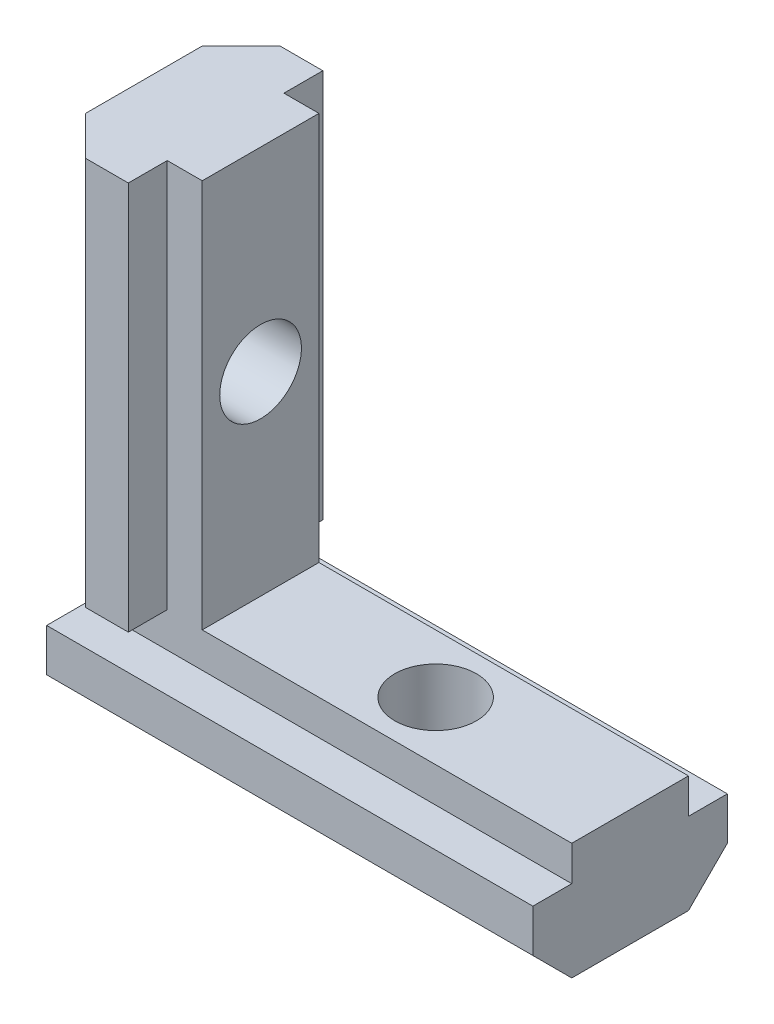
ISO-10303-21;
HEADER;
FILE_DESCRIPTION(('STEP AP214'),'2;1');
FILE_NAME('part.step','',(''),(''),'','','');
FILE_SCHEMA(('AUTOMOTIVE_DESIGN { 1 0 10303 214 1 1 1 1 }'));
ENDSEC;
DATA;
#1=APPLICATION_CONTEXT('core data for automotive mechanical design processes');
#2=APPLICATION_PROTOCOL_DEFINITION('international standard','automotive_design',2000,#1);
#3=PRODUCT_CONTEXT('',#1,'mechanical');
#4=PRODUCT('Part','Part','',(#3));
#5=PRODUCT_RELATED_PRODUCT_CATEGORY('part','',(#4));
#6=PRODUCT_DEFINITION_FORMATION('','',#4);
#7=PRODUCT_DEFINITION_CONTEXT('part definition',#1,'design');
#8=PRODUCT_DEFINITION('design','',#6,#7);
#9=PRODUCT_DEFINITION_SHAPE('','',#8);
#10=(LENGTH_UNIT() NAMED_UNIT(*) SI_UNIT(.MILLI.,.METRE.));
#11=(NAMED_UNIT(*) PLANE_ANGLE_UNIT() SI_UNIT($,.RADIAN.));
#12=(NAMED_UNIT(*) SI_UNIT($,.STERADIAN.) SOLID_ANGLE_UNIT());
#13=UNCERTAINTY_MEASURE_WITH_UNIT(LENGTH_MEASURE(1.E-05),#10,'distance_accuracy_value','');
#14=(GEOMETRIC_REPRESENTATION_CONTEXT(3) GLOBAL_UNCERTAINTY_ASSIGNED_CONTEXT((#13)) GLOBAL_UNIT_ASSIGNED_CONTEXT((#10,
#11,#12)) REPRESENTATION_CONTEXT('',''));
#15=CARTESIAN_POINT('',(0.,0.,0.));
#16=DIRECTION('',(0.,0.,1.));
#17=DIRECTION('',(1.,0.,0.));
#18=AXIS2_PLACEMENT_3D('',#15,#16,#17);
#19=CARTESIAN_POINT('',(0.,0.,0.));
#20=DIRECTION('',(0.,1.,0.));
#21=DIRECTION('',(0.,0.,1.));
#22=AXIS2_PLACEMENT_3D('',#19,#20,#21);
#23=PLANE('',#22);
#24=DIRECTION('',(-1.,0.,0.));
#25=VECTOR('',#24,1.);
#26=CARTESIAN_POINT('',(22.,0.,3.00000000000001));
#27=LINE('',#26,#25);
#28=CARTESIAN_POINT('',(1.2,0.,3.));
#29=VERTEX_POINT('',#28);
#30=CARTESIAN_POINT('',(-3.,0.,3.));
#31=VERTEX_POINT('',#30);
#32=EDGE_CURVE('E11',#29,#31,#27,.T.);
#33=ORIENTED_EDGE('',*,*,#32,.F.);
#34=DIRECTION('',(0.,0.,-1.));
#35=VECTOR('',#34,1.);
#36=CARTESIAN_POINT('',(1.2,0.,5.));
#37=LINE('',#36,#35);
#38=CARTESIAN_POINT('',(1.2,0.,5.));
#39=VERTEX_POINT('',#38);
#40=EDGE_CURVE('E134',#39,#29,#37,.T.);
#41=ORIENTED_EDGE('',*,*,#40,.F.);
#42=DIRECTION('',(1.,0.,0.));
#43=VECTOR('',#42,1.);
#44=CARTESIAN_POINT('',(-1.00000000000002,0.,5.));
#45=LINE('',#44,#43);
#46=CARTESIAN_POINT('',(-1.00000000000002,0.,5.));
#47=VERTEX_POINT('',#46);
#48=EDGE_CURVE('E88',#47,#39,#45,.T.);
#49=ORIENTED_EDGE('',*,*,#48,.F.);
#50=DIRECTION('',(0.707106781186544,0.,0.707106781186551));
#51=VECTOR('',#50,1.);
#52=CARTESIAN_POINT('',(-3.,0.,3.));
#53=LINE('',#52,#51);
#54=EDGE_CURVE('E81',#31,#47,#53,.T.);
#55=ORIENTED_EDGE('',*,*,#54,.F.);
#56=EDGE_LOOP('',(#33,#41,#49,#55));
#57=FACE_BOUND('',#56,.T.);
#58=ADVANCED_FACE('F40',(#57),#23,.F.);
#59=CARTESIAN_POINT('',(1.2,20.,-3.));
#60=DIRECTION('',(0.,0.,1.));
#61=DIRECTION('',(1.,0.,0.));
#62=AXIS2_PLACEMENT_3D('',#59,#60,#61);
#63=PLANE('',#62);
#64=DIRECTION('',(0.,-1.,0.));
#65=VECTOR('',#64,1.);
#66=CARTESIAN_POINT('',(3.,20.,-3.));
#67=LINE('',#66,#65);
#68=CARTESIAN_POINT('',(3.,20.,-3.));
#69=VERTEX_POINT('',#68);
#70=CARTESIAN_POINT('',(3.,0.,-3.));
#71=VERTEX_POINT('',#70);
#72=EDGE_CURVE('E143',#69,#71,#67,.T.);
#73=ORIENTED_EDGE('',*,*,#72,.T.);
#74=DIRECTION('',(-1.,0.,0.));
#75=VECTOR('',#74,1.);
#76=CARTESIAN_POINT('',(22.,0.,-2.99999999999999));
#77=LINE('',#76,#75);
#78=CARTESIAN_POINT('',(22.,0.,-2.99999999999999));
#79=VERTEX_POINT('',#78);
#80=EDGE_CURVE('E150',#79,#71,#77,.T.);
#81=ORIENTED_EDGE('',*,*,#80,.F.);
#82=DIRECTION('',(0.,-1.,0.));
#83=VECTOR('',#82,1.);
#84=CARTESIAN_POINT('',(22.,-1.8,-2.99999999999999));
#85=LINE('',#84,#83);
#86=CARTESIAN_POINT('',(22.,-1.8,-2.99999999999999));
#87=VERTEX_POINT('',#86);
#88=EDGE_CURVE('E254',#79,#87,#85,.T.);
#89=ORIENTED_EDGE('',*,*,#88,.T.);
#90=DIRECTION('',(-1.,0.,0.));
#91=VECTOR('',#90,1.);
#92=CARTESIAN_POINT('',(22.,-1.8,-2.99999999999999));
#93=LINE('',#92,#91);
#94=CARTESIAN_POINT('',(-3.,-1.8,-3.));
#95=VERTEX_POINT('',#94);
#96=EDGE_CURVE('E219',#87,#95,#93,.T.);
#97=ORIENTED_EDGE('',*,*,#96,.T.);
#98=DIRECTION('',(0.,-1.,0.));
#99=VECTOR('',#98,1.);
#100=CARTESIAN_POINT('',(-3.,-1.8,-3.));
#101=LINE('',#100,#99);
#102=CARTESIAN_POINT('',(-3.,0.,-3.));
#103=VERTEX_POINT('',#102);
#104=EDGE_CURVE('E277',#103,#95,#101,.T.);
#105=ORIENTED_EDGE('',*,*,#104,.F.);
#106=CARTESIAN_POINT('',(1.2,0.,-3.));
#107=VERTEX_POINT('',#106);
#108=EDGE_CURVE('E50',#107,#103,#77,.T.);
#109=ORIENTED_EDGE('',*,*,#108,.F.);
#110=DIRECTION('',(0.,-1.,0.));
#111=VECTOR('',#110,1.);
#112=CARTESIAN_POINT('',(1.2,20.,-3.));
#113=LINE('',#112,#111);
#114=CARTESIAN_POINT('',(1.2,20.,-3.));
#115=VERTEX_POINT('',#114);
#116=EDGE_CURVE('E44',#115,#107,#113,.T.);
#117=ORIENTED_EDGE('',*,*,#116,.F.);
#118=DIRECTION('',(-1.,0.,0.));
#119=VECTOR('',#118,1.);
#120=CARTESIAN_POINT('',(1.2,20.,-3.));
#121=LINE('',#120,#119);
#122=EDGE_CURVE('E161',#69,#115,#121,.T.);
#123=ORIENTED_EDGE('',*,*,#122,.F.);
#124=EDGE_LOOP('',(#73,#81,#89,#97,#105,#109,#117,#123));
#125=FACE_BOUND('',#124,.T.);
#126=ADVANCED_FACE('F42',(#125),#63,.F.);
#127=CARTESIAN_POINT('',(1.2,20.,-5.));
#128=DIRECTION('',(-1.,0.,0.));
#129=DIRECTION('',(0.,0.,1.));
#130=AXIS2_PLACEMENT_3D('',#127,#128,#129);
#131=PLANE('',#130);
#132=DIRECTION('',(0.,0.,-1.));
#133=VECTOR('',#132,1.);
#134=CARTESIAN_POINT('',(1.2,0.,-5.));
#135=LINE('',#134,#133);
#136=CARTESIAN_POINT('',(1.2,0.,-5.));
#137=VERTEX_POINT('',#136);
#138=EDGE_CURVE('E147',#107,#137,#135,.T.);
#139=ORIENTED_EDGE('',*,*,#138,.T.);
#140=DIRECTION('',(0.,-1.,0.));
#141=VECTOR('',#140,1.);
#142=CARTESIAN_POINT('',(1.2,20.,-5.));
#143=LINE('',#142,#141);
#144=CARTESIAN_POINT('',(1.2,20.,-5.));
#145=VERTEX_POINT('',#144);
#146=EDGE_CURVE('E175',#145,#137,#143,.T.);
#147=ORIENTED_EDGE('',*,*,#146,.F.);
#148=DIRECTION('',(0.,0.,-1.));
#149=VECTOR('',#148,1.);
#150=CARTESIAN_POINT('',(1.2,20.,-5.));
#151=LINE('',#150,#149);
#152=EDGE_CURVE('E97',#115,#145,#151,.T.);
#153=ORIENTED_EDGE('',*,*,#152,.F.);
#154=ORIENTED_EDGE('',*,*,#116,.T.);
#155=EDGE_LOOP('',(#139,#147,#153,#154));
#156=FACE_BOUND('',#155,.T.);
#157=ADVANCED_FACE('F357',(#156),#131,.F.);
#158=CARTESIAN_POINT('',(-1.00000000000002,20.,-5.));
#159=DIRECTION('',(0.,0.,1.));
#160=DIRECTION('',(1.,0.,0.));
#161=AXIS2_PLACEMENT_3D('',#158,#159,#160);
#162=PLANE('',#161);
#163=DIRECTION('',(-1.,0.,0.));
#164=VECTOR('',#163,1.);
#165=CARTESIAN_POINT('',(-1.00000000000002,0.,-5.));
#166=LINE('',#165,#164);
#167=CARTESIAN_POINT('',(-1.00000000000002,0.,-5.));
#168=VERTEX_POINT('',#167);
#169=EDGE_CURVE('E149',#137,#168,#166,.T.);
#170=ORIENTED_EDGE('',*,*,#169,.T.);
#171=DIRECTION('',(0.,-1.,0.));
#172=VECTOR('',#171,1.);
#173=CARTESIAN_POINT('',(-1.00000000000002,20.,-5.));
#174=LINE('',#173,#172);
#175=CARTESIAN_POINT('',(-1.00000000000002,20.,-5.));
#176=VERTEX_POINT('',#175);
#177=EDGE_CURVE('E173',#176,#168,#174,.T.);
#178=ORIENTED_EDGE('',*,*,#177,.F.);
#179=DIRECTION('',(-1.,0.,0.));
#180=VECTOR('',#179,1.);
#181=CARTESIAN_POINT('',(-1.00000000000002,20.,-5.));
#182=LINE('',#181,#180);
#183=EDGE_CURVE('E225',#145,#176,#182,.T.);
#184=ORIENTED_EDGE('',*,*,#183,.F.);
#185=ORIENTED_EDGE('',*,*,#146,.T.);
#186=EDGE_LOOP('',(#170,#178,#184,#185));
#187=FACE_BOUND('',#186,.T.);
#188=ADVANCED_FACE('F359',(#187),#162,.F.);
#189=CARTESIAN_POINT('',(-3.,20.,-3.));
#190=DIRECTION('',(0.707106781186551,0.,0.707106781186544));
#191=DIRECTION('',(0.707106781186544,0.,-0.707106781186551));
#192=AXIS2_PLACEMENT_3D('',#189,#190,#191);
#193=PLANE('',#192);
#194=DIRECTION('',(-0.707106781186544,0.,0.707106781186551));
#195=VECTOR('',#194,1.);
#196=CARTESIAN_POINT('',(-3.,0.,-3.));
#197=LINE('',#196,#195);
#198=EDGE_CURVE('E152',#168,#103,#197,.T.);
#199=ORIENTED_EDGE('',*,*,#198,.T.);
#200=DIRECTION('',(0.,-1.,0.));
#201=VECTOR('',#200,1.);
#202=CARTESIAN_POINT('',(-3.,20.,-3.));
#203=LINE('',#202,#201);
#204=CARTESIAN_POINT('',(-3.,20.,-3.));
#205=VERTEX_POINT('',#204);
#206=EDGE_CURVE('E170',#205,#103,#203,.T.);
#207=ORIENTED_EDGE('',*,*,#206,.F.);
#208=DIRECTION('',(-0.707106781186544,0.,0.707106781186551));
#209=VECTOR('',#208,1.);
#210=CARTESIAN_POINT('',(-3.,20.,-3.));
#211=LINE('',#210,#209);
#212=EDGE_CURVE('E227',#176,#205,#211,.T.);
#213=ORIENTED_EDGE('',*,*,#212,.F.);
#214=ORIENTED_EDGE('',*,*,#177,.T.);
#215=EDGE_LOOP('',(#199,#207,#213,#214));
#216=FACE_BOUND('',#215,.T.);
#217=ADVANCED_FACE('F406',(#216),#193,.F.);
#218=CARTESIAN_POINT('',(-3.,20.,-3.));
#219=DIRECTION('',(1.,0.,0.));
#220=DIRECTION('',(0.,0.,-1.));
#221=AXIS2_PLACEMENT_3D('',#218,#219,#220);
#222=PLANE('',#221);
#223=CARTESIAN_POINT('',(-3.,10.,0.));
#224=DIRECTION('',(-1.,0.,0.));
#225=DIRECTION('',(0.,0.,1.));
#226=AXIS2_PLACEMENT_3D('',#223,#224,#225);
#227=CIRCLE('',#226,2.09999999999999);
#228=CARTESIAN_POINT('',(-3.,10.,2.09999999999999));
#229=VERTEX_POINT('',#228);
#230=EDGE_CURVE('E306',#229,#229,#227,.T.);
#231=ORIENTED_EDGE('',*,*,#230,.F.);
#232=EDGE_LOOP('',(#231));
#233=FACE_BOUND('',#232,.T.);
#234=ORIENTED_EDGE('',*,*,#206,.T.);
#235=ORIENTED_EDGE('',*,*,#104,.T.);
#236=DIRECTION('',(0.,0.,-1.));
#237=VECTOR('',#236,1.);
#238=CARTESIAN_POINT('',(-3.,-1.8,-4.99999999999999));
#239=LINE('',#238,#237);
#240=CARTESIAN_POINT('',(-3.,-1.8,-4.99999999999999));
#241=VERTEX_POINT('',#240);
#242=EDGE_CURVE('E274',#95,#241,#239,.T.);
#243=ORIENTED_EDGE('',*,*,#242,.T.);
#244=DIRECTION('',(0.,-1.,0.));
#245=VECTOR('',#244,1.);
#246=CARTESIAN_POINT('',(-3.,-4.00000000000003,-4.99999999999999));
#247=LINE('',#246,#245);
#248=CARTESIAN_POINT('',(-3.,-4.00000000000003,-4.99999999999999));
#249=VERTEX_POINT('',#248);
#250=EDGE_CURVE('E271',#241,#249,#247,.T.);
#251=ORIENTED_EDGE('',*,*,#250,.T.);
#252=DIRECTION('',(0.,-0.707106781186544,0.707106781186551));
#253=VECTOR('',#252,1.);
#254=CARTESIAN_POINT('',(-3.,-6.,-2.99999999999999));
#255=LINE('',#254,#253);
#256=CARTESIAN_POINT('',(-3.,-6.,-2.99999999999999));
#257=VERTEX_POINT('',#256);
#258=EDGE_CURVE('E268',#249,#257,#255,.T.);
#259=ORIENTED_EDGE('',*,*,#258,.T.);
#260=DIRECTION('',(0.,0.,1.));
#261=VECTOR('',#260,1.);
#262=CARTESIAN_POINT('',(-3.,-6.,-2.99999999999999));
#263=LINE('',#262,#261);
#264=CARTESIAN_POINT('',(-3.,-6.,3.00000000000001));
#265=VERTEX_POINT('',#264);
#266=EDGE_CURVE('E265',#257,#265,#263,.T.);
#267=ORIENTED_EDGE('',*,*,#266,.T.);
#268=DIRECTION('',(0.,0.707106781186544,0.707106781186551));
#269=VECTOR('',#268,1.);
#270=CARTESIAN_POINT('',(-3.,-6.,3.00000000000001));
#271=LINE('',#270,#269);
#272=CARTESIAN_POINT('',(-3.,-4.00000000000003,5.));
#273=VERTEX_POINT('',#272);
#274=EDGE_CURVE('E262',#265,#273,#271,.T.);
#275=ORIENTED_EDGE('',*,*,#274,.T.);
#276=DIRECTION('',(0.,1.,0.));
#277=VECTOR('',#276,1.);
#278=CARTESIAN_POINT('',(-3.,-4.00000000000003,5.));
#279=LINE('',#278,#277);
#280=CARTESIAN_POINT('',(-3.,-1.8,5.));
#281=VERTEX_POINT('',#280);
#282=EDGE_CURVE('E258',#273,#281,#279,.T.);
#283=ORIENTED_EDGE('',*,*,#282,.T.);
#284=DIRECTION('',(0.,0.,-1.));
#285=VECTOR('',#284,1.);
#286=CARTESIAN_POINT('',(-3.,-1.8,5.));
#287=LINE('',#286,#285);
#288=CARTESIAN_POINT('',(-3.,-1.8,3.00000000000001));
#289=VERTEX_POINT('',#288);
#290=EDGE_CURVE('E253',#281,#289,#287,.T.);
#291=ORIENTED_EDGE('',*,*,#290,.T.);
#292=DIRECTION('',(0.,1.,0.));
#293=VECTOR('',#292,1.);
#294=CARTESIAN_POINT('',(-3.,-1.8,3.00000000000001));
#295=LINE('',#294,#293);
#296=EDGE_CURVE('E245',#289,#31,#295,.T.);
#297=ORIENTED_EDGE('',*,*,#296,.T.);
#298=DIRECTION('',(0.,-1.,0.));
#299=VECTOR('',#298,1.);
#300=CARTESIAN_POINT('',(-3.,20.,3.));
#301=LINE('',#300,#299);
#302=CARTESIAN_POINT('',(-3.,20.,3.));
#303=VERTEX_POINT('',#302);
#304=EDGE_CURVE('E168',#303,#31,#301,.T.);
#305=ORIENTED_EDGE('',*,*,#304,.F.);
#306=DIRECTION('',(0.,0.,1.));
#307=VECTOR('',#306,1.);
#308=CARTESIAN_POINT('',(-3.,20.,-3.));
#309=LINE('',#308,#307);
#310=EDGE_CURVE('E229',#205,#303,#309,.T.);
#311=ORIENTED_EDGE('',*,*,#310,.F.);
#312=EDGE_LOOP('',(#234,#235,#243,#251,#259,#267,#275,#283,#291,#297,#305,#311));
#313=FACE_BOUND('',#312,.T.);
#314=ADVANCED_FACE('F250',(#233,#313),#222,.F.);
#315=CARTESIAN_POINT('',(-3.,20.,3.));
#316=DIRECTION('',(0.707106781186551,0.,-0.707106781186544));
#317=DIRECTION('',(-0.707106781186544,0.,-0.707106781186551));
#318=AXIS2_PLACEMENT_3D('',#315,#316,#317);
#319=PLANE('',#318);
#320=ORIENTED_EDGE('',*,*,#54,.T.);
#321=DIRECTION('',(0.,-1.,0.));
#322=VECTOR('',#321,1.);
#323=CARTESIAN_POINT('',(-1.00000000000002,20.,5.));
#324=LINE('',#323,#322);
#325=CARTESIAN_POINT('',(-1.00000000000002,20.,5.));
#326=VERTEX_POINT('',#325);
#327=EDGE_CURVE('E166',#326,#47,#324,.T.);
#328=ORIENTED_EDGE('',*,*,#327,.F.);
#329=DIRECTION('',(0.707106781186544,0.,0.707106781186551));
#330=VECTOR('',#329,1.);
#331=CARTESIAN_POINT('',(-3.,20.,3.));
#332=LINE('',#331,#330);
#333=EDGE_CURVE('E231',#303,#326,#332,.T.);
#334=ORIENTED_EDGE('',*,*,#333,.F.);
#335=ORIENTED_EDGE('',*,*,#304,.T.);
#336=EDGE_LOOP('',(#320,#328,#334,#335));
#337=FACE_BOUND('',#336,.T.);
#338=ADVANCED_FACE('F235',(#337),#319,.F.);
#339=CARTESIAN_POINT('',(-1.00000000000002,20.,5.));
#340=DIRECTION('',(0.,0.,-1.));
#341=DIRECTION('',(-1.,0.,0.));
#342=AXIS2_PLACEMENT_3D('',#339,#340,#341);
#343=PLANE('',#342);
#344=ORIENTED_EDGE('',*,*,#48,.T.);
#345=DIRECTION('',(0.,-1.,0.));
#346=VECTOR('',#345,1.);
#347=CARTESIAN_POINT('',(1.2,20.,5.));
#348=LINE('',#347,#346);
#349=CARTESIAN_POINT('',(1.2,20.,5.));
#350=VERTEX_POINT('',#349);
#351=EDGE_CURVE('E136',#350,#39,#348,.T.);
#352=ORIENTED_EDGE('',*,*,#351,.F.);
#353=DIRECTION('',(1.,0.,0.));
#354=VECTOR('',#353,1.);
#355=CARTESIAN_POINT('',(-1.00000000000002,20.,5.));
#356=LINE('',#355,#354);
#357=EDGE_CURVE('E125',#326,#350,#356,.T.);
#358=ORIENTED_EDGE('',*,*,#357,.F.);
#359=ORIENTED_EDGE('',*,*,#327,.T.);
#360=EDGE_LOOP('',(#344,#352,#358,#359));
#361=FACE_BOUND('',#360,.T.);
#362=ADVANCED_FACE('F236',(#361),#343,.F.);
#363=CARTESIAN_POINT('',(1.2,20.,5.));
#364=DIRECTION('',(-1.,0.,0.));
#365=DIRECTION('',(0.,0.,1.));
#366=AXIS2_PLACEMENT_3D('',#363,#364,#365);
#367=PLANE('',#366);
#368=ORIENTED_EDGE('',*,*,#40,.T.);
#369=DIRECTION('',(0.,-1.,0.));
#370=VECTOR('',#369,1.);
#371=CARTESIAN_POINT('',(1.2,20.,3.));
#372=LINE('',#371,#370);
#373=CARTESIAN_POINT('',(1.2,20.,3.));
#374=VERTEX_POINT('',#373);
#375=EDGE_CURVE('E130',#374,#29,#372,.T.);
#376=ORIENTED_EDGE('',*,*,#375,.F.);
#377=DIRECTION('',(0.,0.,-1.));
#378=VECTOR('',#377,1.);
#379=CARTESIAN_POINT('',(1.2,20.,5.));
#380=LINE('',#379,#378);
#381=EDGE_CURVE('E118',#350,#374,#380,.T.);
#382=ORIENTED_EDGE('',*,*,#381,.F.);
#383=ORIENTED_EDGE('',*,*,#351,.T.);
#384=EDGE_LOOP('',(#368,#376,#382,#383));
#385=FACE_BOUND('',#384,.T.);
#386=ADVANCED_FACE('F131',(#385),#367,.F.);
#387=CARTESIAN_POINT('',(1.2,20.,3.));
#388=DIRECTION('',(0.,0.,-1.));
#389=DIRECTION('',(-1.,0.,0.));
#390=AXIS2_PLACEMENT_3D('',#387,#388,#389);
#391=PLANE('',#390);
#392=ORIENTED_EDGE('',*,*,#375,.T.);
#393=ORIENTED_EDGE('',*,*,#32,.T.);
#394=ORIENTED_EDGE('',*,*,#296,.F.);
#395=DIRECTION('',(-1.,0.,0.));
#396=VECTOR('',#395,1.);
#397=CARTESIAN_POINT('',(22.,-1.8,3.00000000000001));
#398=LINE('',#397,#396);
#399=CARTESIAN_POINT('',(22.,-1.8,3.00000000000001));
#400=VERTEX_POINT('',#399);
#401=EDGE_CURVE('E194',#400,#289,#398,.T.);
#402=ORIENTED_EDGE('',*,*,#401,.F.);
#403=DIRECTION('',(0.,1.,0.));
#404=VECTOR('',#403,1.);
#405=CARTESIAN_POINT('',(22.,-1.8,3.00000000000001));
#406=LINE('',#405,#404);
#407=CARTESIAN_POINT('',(22.,0.,3.00000000000001));
#408=VERTEX_POINT('',#407);
#409=EDGE_CURVE('E282',#400,#408,#406,.T.);
#410=ORIENTED_EDGE('',*,*,#409,.T.);
#411=CARTESIAN_POINT('',(3.,0.,3.00000000000001));
#412=VERTEX_POINT('',#411);
#413=EDGE_CURVE('E52',#408,#412,#27,.T.);
#414=ORIENTED_EDGE('',*,*,#413,.T.);
#415=DIRECTION('',(0.,-1.,0.));
#416=VECTOR('',#415,1.);
#417=CARTESIAN_POINT('',(3.,20.,3.));
#418=LINE('',#417,#416);
#419=CARTESIAN_POINT('',(3.,20.,3.));
#420=VERTEX_POINT('',#419);
#421=EDGE_CURVE('E137',#420,#412,#418,.T.);
#422=ORIENTED_EDGE('',*,*,#421,.F.);
#423=DIRECTION('',(1.,0.,0.));
#424=VECTOR('',#423,1.);
#425=CARTESIAN_POINT('',(1.2,20.,3.));
#426=LINE('',#425,#424);
#427=EDGE_CURVE('E122',#374,#420,#426,.T.);
#428=ORIENTED_EDGE('',*,*,#427,.F.);
#429=EDGE_LOOP('',(#392,#393,#394,#402,#410,#414,#422,#428));
#430=FACE_BOUND('',#429,.T.);
#431=ADVANCED_FACE('F139',(#430),#391,.F.);
#432=CARTESIAN_POINT('',(3.,20.,3.));
#433=DIRECTION('',(-1.,0.,0.));
#434=DIRECTION('',(0.,0.,1.));
#435=AXIS2_PLACEMENT_3D('',#432,#433,#434);
#436=PLANE('',#435);
#437=CARTESIAN_POINT('',(3.,10.,0.));
#438=DIRECTION('',(-1.,0.,0.));
#439=DIRECTION('',(0.,0.,1.));
#440=AXIS2_PLACEMENT_3D('',#437,#438,#439);
#441=CIRCLE('',#440,2.09999999999999);
#442=CARTESIAN_POINT('',(3.,10.,2.09999999999999));
#443=VERTEX_POINT('',#442);
#444=EDGE_CURVE('E280',#443,#443,#441,.T.);
#445=ORIENTED_EDGE('',*,*,#444,.T.);
#446=EDGE_LOOP('',(#445));
#447=FACE_BOUND('',#446,.T.);
#448=DIRECTION('',(0.,0.,-1.));
#449=VECTOR('',#448,1.);
#450=CARTESIAN_POINT('',(3.,0.,3.));
#451=LINE('',#450,#449);
#452=EDGE_CURVE('E158',#412,#71,#451,.T.);
#453=ORIENTED_EDGE('',*,*,#452,.T.);
#454=ORIENTED_EDGE('',*,*,#72,.F.);
#455=DIRECTION('',(0.,0.,-1.));
#456=VECTOR('',#455,1.);
#457=CARTESIAN_POINT('',(3.,20.,3.));
#458=LINE('',#457,#456);
#459=EDGE_CURVE('E60',#420,#69,#458,.T.);
#460=ORIENTED_EDGE('',*,*,#459,.F.);
#461=ORIENTED_EDGE('',*,*,#421,.T.);
#462=EDGE_LOOP('',(#453,#454,#460,#461));
#463=FACE_BOUND('',#462,.T.);
#464=ADVANCED_FACE('F364',(#447,#463),#436,.F.);
#465=CARTESIAN_POINT('',(0.,20.,0.));
#466=DIRECTION('',(0.,1.,0.));
#467=DIRECTION('',(0.,0.,1.));
#468=AXIS2_PLACEMENT_3D('',#465,#466,#467);
#469=PLANE('',#468);
#470=ORIENTED_EDGE('',*,*,#122,.T.);
#471=ORIENTED_EDGE('',*,*,#152,.T.);
#472=ORIENTED_EDGE('',*,*,#183,.T.);
#473=ORIENTED_EDGE('',*,*,#212,.T.);
#474=ORIENTED_EDGE('',*,*,#310,.T.);
#475=ORIENTED_EDGE('',*,*,#333,.T.);
#476=ORIENTED_EDGE('',*,*,#357,.T.);
#477=ORIENTED_EDGE('',*,*,#381,.T.);
#478=ORIENTED_EDGE('',*,*,#427,.T.);
#479=ORIENTED_EDGE('',*,*,#459,.T.);
#480=EDGE_LOOP('',(#470,#471,#472,#473,#474,#475,#476,#477,#478,#479));
#481=FACE_BOUND('',#480,.T.);
#482=ADVANCED_FACE('F120',(#481),#469,.T.);
#483=ORIENTED_EDGE('',*,*,#138,.F.);
#484=ORIENTED_EDGE('',*,*,#108,.T.);
#485=ORIENTED_EDGE('',*,*,#198,.F.);
#486=ORIENTED_EDGE('',*,*,#169,.F.);
#487=EDGE_LOOP('',(#483,#484,#485,#486));
#488=FACE_BOUND('',#487,.T.);
#489=ADVANCED_FACE('F356',(#488),#23,.F.);
#490=CARTESIAN_POINT('',(22.,0.,3.00000000000001));
#491=DIRECTION('',(0.,1.,0.));
#492=DIRECTION('',(0.,0.,1.));
#493=AXIS2_PLACEMENT_3D('',#490,#491,#492);
#494=PLANE('',#493);
#495=CARTESIAN_POINT('',(12.,0.,0.));
#496=DIRECTION('',(0.,1.,0.));
#497=DIRECTION('',(0.,0.,1.));
#498=AXIS2_PLACEMENT_3D('',#495,#496,#497);
#499=CIRCLE('',#498,2.09999999999999);
#500=CARTESIAN_POINT('',(12.,0.,2.1));
#501=VERTEX_POINT('',#500);
#502=EDGE_CURVE('E309',#501,#501,#499,.T.);
#503=ORIENTED_EDGE('',*,*,#502,.F.);
#504=EDGE_LOOP('',(#503));
#505=FACE_BOUND('',#504,.T.);
#506=ORIENTED_EDGE('',*,*,#452,.F.);
#507=ORIENTED_EDGE('',*,*,#413,.F.);
#508=DIRECTION('',(0.,0.,-1.));
#509=VECTOR('',#508,1.);
#510=CARTESIAN_POINT('',(22.,0.,3.00000000000001));
#511=LINE('',#510,#509);
#512=EDGE_CURVE('E222',#408,#79,#511,.T.);
#513=ORIENTED_EDGE('',*,*,#512,.T.);
#514=ORIENTED_EDGE('',*,*,#80,.T.);
#515=EDGE_LOOP('',(#506,#507,#513,#514));
#516=FACE_BOUND('',#515,.T.);
#517=ADVANCED_FACE('F365',(#505,#516),#494,.T.);
#518=CARTESIAN_POINT('',(22.,-1.8,5.));
#519=DIRECTION('',(0.,1.,0.));
#520=DIRECTION('',(0.,0.,1.));
#521=AXIS2_PLACEMENT_3D('',#518,#519,#520);
#522=PLANE('',#521);
#523=ORIENTED_EDGE('',*,*,#290,.F.);
#524=DIRECTION('',(-1.,0.,0.));
#525=VECTOR('',#524,1.);
#526=CARTESIAN_POINT('',(22.,-1.8,5.));
#527=LINE('',#526,#525);
#528=CARTESIAN_POINT('',(22.,-1.8,5.));
#529=VERTEX_POINT('',#528);
#530=EDGE_CURVE('E199',#529,#281,#527,.T.);
#531=ORIENTED_EDGE('',*,*,#530,.F.);
#532=DIRECTION('',(0.,0.,-1.));
#533=VECTOR('',#532,1.);
#534=CARTESIAN_POINT('',(22.,-1.8,5.));
#535=LINE('',#534,#533);
#536=EDGE_CURVE('E284',#529,#400,#535,.T.);
#537=ORIENTED_EDGE('',*,*,#536,.T.);
#538=ORIENTED_EDGE('',*,*,#401,.T.);
#539=EDGE_LOOP('',(#523,#531,#537,#538));
#540=FACE_BOUND('',#539,.T.);
#541=ADVANCED_FACE('F396',(#540),#522,.T.);
#542=CARTESIAN_POINT('',(22.,-4.00000000000003,5.00000000000001));
#543=DIRECTION('',(0.,0.,1.));
#544=DIRECTION('',(0.,-1.,0.));
#545=AXIS2_PLACEMENT_3D('',#542,#543,#544);
#546=PLANE('',#545);
#547=ORIENTED_EDGE('',*,*,#282,.F.);
#548=DIRECTION('',(-1.,0.,0.));
#549=VECTOR('',#548,1.);
#550=CARTESIAN_POINT('',(22.,-4.00000000000003,5.00000000000001));
#551=LINE('',#550,#549);
#552=CARTESIAN_POINT('',(22.,-4.00000000000003,5.00000000000001));
#553=VERTEX_POINT('',#552);
#554=EDGE_CURVE('E204',#553,#273,#551,.T.);
#555=ORIENTED_EDGE('',*,*,#554,.F.);
#556=DIRECTION('',(0.,1.,0.));
#557=VECTOR('',#556,1.);
#558=CARTESIAN_POINT('',(22.,-4.00000000000003,5.00000000000001));
#559=LINE('',#558,#557);
#560=EDGE_CURVE('E287',#553,#529,#559,.T.);
#561=ORIENTED_EDGE('',*,*,#560,.T.);
#562=ORIENTED_EDGE('',*,*,#530,.T.);
#563=EDGE_LOOP('',(#547,#555,#561,#562));
#564=FACE_BOUND('',#563,.T.);
#565=ADVANCED_FACE('F401',(#564),#546,.T.);
#566=CARTESIAN_POINT('',(22.,-6.,3.00000000000001));
#567=DIRECTION('',(0.,-0.707106781186551,0.707106781186544));
#568=DIRECTION('',(0.,-0.707106781186544,-0.707106781186551));
#569=AXIS2_PLACEMENT_3D('',#566,#567,#568);
#570=PLANE('',#569);
#571=ORIENTED_EDGE('',*,*,#274,.F.);
#572=DIRECTION('',(-1.,0.,0.));
#573=VECTOR('',#572,1.);
#574=CARTESIAN_POINT('',(22.,-6.,3.00000000000001));
#575=LINE('',#574,#573);
#576=CARTESIAN_POINT('',(22.,-6.,3.00000000000001));
#577=VERTEX_POINT('',#576);
#578=EDGE_CURVE('E207',#577,#265,#575,.T.);
#579=ORIENTED_EDGE('',*,*,#578,.F.);
#580=DIRECTION('',(0.,0.707106781186544,0.707106781186551));
#581=VECTOR('',#580,1.);
#582=CARTESIAN_POINT('',(22.,-6.,3.00000000000001));
#583=LINE('',#582,#581);
#584=EDGE_CURVE('E290',#577,#553,#583,.T.);
#585=ORIENTED_EDGE('',*,*,#584,.T.);
#586=ORIENTED_EDGE('',*,*,#554,.T.);
#587=EDGE_LOOP('',(#571,#579,#585,#586));
#588=FACE_BOUND('',#587,.T.);
#589=ADVANCED_FACE('F322',(#588),#570,.T.);
#590=CARTESIAN_POINT('',(22.,-6.,-2.99999999999999));
#591=DIRECTION('',(0.,-1.,0.));
#592=DIRECTION('',(0.,0.,-1.));
#593=AXIS2_PLACEMENT_3D('',#590,#591,#592);
#594=PLANE('',#593);
#595=CARTESIAN_POINT('',(12.,-6.00000000000001,0.));
#596=DIRECTION('',(0.,-1.,0.));
#597=DIRECTION('',(0.,0.,-1.));
#598=AXIS2_PLACEMENT_3D('',#595,#596,#597);
#599=CIRCLE('',#598,2.09999999999999);
#600=CARTESIAN_POINT('',(12.,-6.00000000000001,-2.09999999999998));
#601=VERTEX_POINT('',#600);
#602=EDGE_CURVE('E312',#601,#601,#599,.T.);
#603=ORIENTED_EDGE('',*,*,#602,.F.);
#604=EDGE_LOOP('',(#603));
#605=FACE_BOUND('',#604,.T.);
#606=ORIENTED_EDGE('',*,*,#266,.F.);
#607=DIRECTION('',(-1.,0.,0.));
#608=VECTOR('',#607,1.);
#609=CARTESIAN_POINT('',(22.,-6.,-2.99999999999999));
#610=LINE('',#609,#608);
#611=CARTESIAN_POINT('',(22.,-6.,-2.99999999999999));
#612=VERTEX_POINT('',#611);
#613=EDGE_CURVE('E210',#612,#257,#610,.T.);
#614=ORIENTED_EDGE('',*,*,#613,.F.);
#615=DIRECTION('',(0.,0.,1.));
#616=VECTOR('',#615,1.);
#617=CARTESIAN_POINT('',(22.,-6.,-2.99999999999999));
#618=LINE('',#617,#616);
#619=EDGE_CURVE('E293',#612,#577,#618,.T.);
#620=ORIENTED_EDGE('',*,*,#619,.T.);
#621=ORIENTED_EDGE('',*,*,#578,.T.);
#622=EDGE_LOOP('',(#606,#614,#620,#621));
#623=FACE_BOUND('',#622,.T.);
#624=ADVANCED_FACE('F318',(#605,#623),#594,.T.);
#625=CARTESIAN_POINT('',(22.,-6.,-2.99999999999999));
#626=DIRECTION('',(0.,-0.707106781186551,-0.707106781186544));
#627=DIRECTION('',(0.,0.707106781186544,-0.707106781186551));
#628=AXIS2_PLACEMENT_3D('',#625,#626,#627);
#629=PLANE('',#628);
#630=ORIENTED_EDGE('',*,*,#258,.F.);
#631=DIRECTION('',(-1.,0.,0.));
#632=VECTOR('',#631,1.);
#633=CARTESIAN_POINT('',(22.,-4.00000000000003,-4.99999999999999));
#634=LINE('',#633,#632);
#635=CARTESIAN_POINT('',(22.,-4.00000000000003,-4.99999999999999));
#636=VERTEX_POINT('',#635);
#637=EDGE_CURVE('E213',#636,#249,#634,.T.);
#638=ORIENTED_EDGE('',*,*,#637,.F.);
#639=DIRECTION('',(0.,-0.707106781186544,0.707106781186551));
#640=VECTOR('',#639,1.);
#641=CARTESIAN_POINT('',(22.,-6.,-2.99999999999999));
#642=LINE('',#641,#640);
#643=EDGE_CURVE('E296',#636,#612,#642,.T.);
#644=ORIENTED_EDGE('',*,*,#643,.T.);
#645=ORIENTED_EDGE('',*,*,#613,.T.);
#646=EDGE_LOOP('',(#630,#638,#644,#645));
#647=FACE_BOUND('',#646,.T.);
#648=ADVANCED_FACE('F321',(#647),#629,.T.);
#649=CARTESIAN_POINT('',(22.,-4.00000000000003,-4.99999999999999));
#650=DIRECTION('',(0.,0.,-1.));
#651=DIRECTION('',(0.,1.,0.));
#652=AXIS2_PLACEMENT_3D('',#649,#650,#651);
#653=PLANE('',#652);
#654=ORIENTED_EDGE('',*,*,#250,.F.);
#655=DIRECTION('',(-1.,0.,0.));
#656=VECTOR('',#655,1.);
#657=CARTESIAN_POINT('',(22.,-1.8,-4.99999999999999));
#658=LINE('',#657,#656);
#659=CARTESIAN_POINT('',(22.,-1.8,-4.99999999999999));
#660=VERTEX_POINT('',#659);
#661=EDGE_CURVE('E216',#660,#241,#658,.T.);
#662=ORIENTED_EDGE('',*,*,#661,.F.);
#663=DIRECTION('',(0.,-1.,0.));
#664=VECTOR('',#663,1.);
#665=CARTESIAN_POINT('',(22.,-4.00000000000003,-4.99999999999999));
#666=LINE('',#665,#664);
#667=EDGE_CURVE('E299',#660,#636,#666,.T.);
#668=ORIENTED_EDGE('',*,*,#667,.T.);
#669=ORIENTED_EDGE('',*,*,#637,.T.);
#670=EDGE_LOOP('',(#654,#662,#668,#669));
#671=FACE_BOUND('',#670,.T.);
#672=ADVANCED_FACE('F403',(#671),#653,.T.);
#673=CARTESIAN_POINT('',(22.,-1.8,-4.99999999999999));
#674=DIRECTION('',(0.,1.,0.));
#675=DIRECTION('',(0.,0.,1.));
#676=AXIS2_PLACEMENT_3D('',#673,#674,#675);
#677=PLANE('',#676);
#678=ORIENTED_EDGE('',*,*,#242,.F.);
#679=ORIENTED_EDGE('',*,*,#96,.F.);
#680=DIRECTION('',(0.,0.,-1.));
#681=VECTOR('',#680,1.);
#682=CARTESIAN_POINT('',(22.,-1.8,-4.99999999999999));
#683=LINE('',#682,#681);
#684=EDGE_CURVE('E256',#87,#660,#683,.T.);
#685=ORIENTED_EDGE('',*,*,#684,.T.);
#686=ORIENTED_EDGE('',*,*,#661,.T.);
#687=EDGE_LOOP('',(#678,#679,#685,#686));
#688=FACE_BOUND('',#687,.T.);
#689=ADVANCED_FACE('F404',(#688),#677,.T.);
#690=CARTESIAN_POINT('',(22.,0.,0.));
#691=DIRECTION('',(-1.,0.,0.));
#692=DIRECTION('',(0.,0.,1.));
#693=AXIS2_PLACEMENT_3D('',#690,#691,#692);
#694=PLANE('',#693);
#695=ORIENTED_EDGE('',*,*,#88,.F.);
#696=ORIENTED_EDGE('',*,*,#512,.F.);
#697=ORIENTED_EDGE('',*,*,#409,.F.);
#698=ORIENTED_EDGE('',*,*,#536,.F.);
#699=ORIENTED_EDGE('',*,*,#560,.F.);
#700=ORIENTED_EDGE('',*,*,#584,.F.);
#701=ORIENTED_EDGE('',*,*,#619,.F.);
#702=ORIENTED_EDGE('',*,*,#643,.F.);
#703=ORIENTED_EDGE('',*,*,#667,.F.);
#704=ORIENTED_EDGE('',*,*,#684,.F.);
#705=EDGE_LOOP('',(#695,#696,#697,#698,#699,#700,#701,#702,#703,#704));
#706=FACE_BOUND('',#705,.T.);
#707=ADVANCED_FACE('F373',(#706),#694,.F.);
#708=CARTESIAN_POINT('',(-3.,10.,0.));
#709=DIRECTION('',(-1.,0.,0.));
#710=DIRECTION('',(0.,0.,1.));
#711=AXIS2_PLACEMENT_3D('',#708,#709,#710);
#712=CYLINDRICAL_SURFACE('',#711,2.09999999999999);
#713=ORIENTED_EDGE('',*,*,#230,.T.);
#714=EDGE_LOOP('',(#713));
#715=FACE_BOUND('',#714,.T.);
#716=ORIENTED_EDGE('',*,*,#444,.F.);
#717=EDGE_LOOP('',(#716));
#718=FACE_BOUND('',#717,.T.);
#719=ADVANCED_FACE('F449',(#715,#718),#712,.F.);
#720=CARTESIAN_POINT('',(12.,-6.,0.));
#721=DIRECTION('',(0.,-1.,0.));
#722=DIRECTION('',(0.,0.,-1.));
#723=AXIS2_PLACEMENT_3D('',#720,#721,#722);
#724=CYLINDRICAL_SURFACE('',#723,2.09999999999999);
#725=ORIENTED_EDGE('',*,*,#502,.T.);
#726=EDGE_LOOP('',(#725));
#727=FACE_BOUND('',#726,.T.);
#728=ORIENTED_EDGE('',*,*,#602,.T.);
#729=EDGE_LOOP('',(#728));
#730=FACE_BOUND('',#729,.T.);
#731=ADVANCED_FACE('F316',(#727,#730),#724,.F.);
#732=CLOSED_SHELL('',(#58,#126,#157,#188,#217,#314,#338,#362,#386,#431,#464,#482,#489,#517,#541,
#565,#589,#624,#648,#672,#689,#707,#719,#731));
#733=MANIFOLD_SOLID_BREP('B2',#732);
#734=ADVANCED_BREP_SHAPE_REPRESENTATION('',(#18,#733),#14);
#735=SHAPE_DEFINITION_REPRESENTATION(#9,#734);
ENDSEC;
END-ISO-10303-21;
